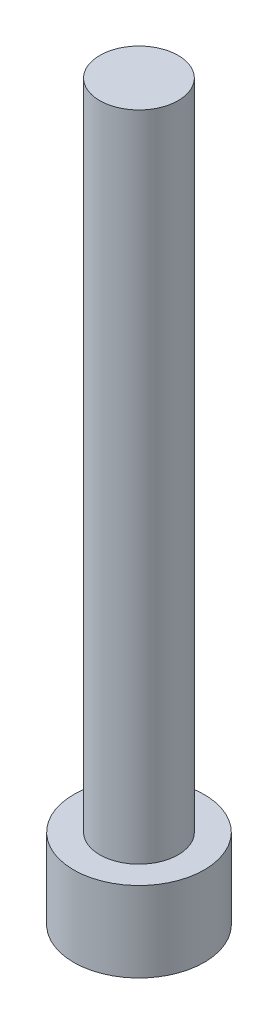
ISO-10303-21;
HEADER;
FILE_DESCRIPTION(('STEP AP214'),'2;1');
FILE_NAME('part.step','',(''),(''),'','','');
FILE_SCHEMA(('AUTOMOTIVE_DESIGN { 1 0 10303 214 1 1 1 1 }'));
ENDSEC;
DATA;
#1=APPLICATION_CONTEXT('core data for automotive mechanical design processes');
#2=APPLICATION_PROTOCOL_DEFINITION('international standard','automotive_design',2000,#1);
#3=PRODUCT_CONTEXT('',#1,'mechanical');
#4=PRODUCT('Part','Part','',(#3));
#5=PRODUCT_RELATED_PRODUCT_CATEGORY('part','',(#4));
#6=PRODUCT_DEFINITION_FORMATION('','',#4);
#7=PRODUCT_DEFINITION_CONTEXT('part definition',#1,'design');
#8=PRODUCT_DEFINITION('design','',#6,#7);
#9=PRODUCT_DEFINITION_SHAPE('','',#8);
#10=(LENGTH_UNIT() NAMED_UNIT(*) SI_UNIT(.MILLI.,.METRE.));
#11=(NAMED_UNIT(*) PLANE_ANGLE_UNIT() SI_UNIT($,.RADIAN.));
#12=(NAMED_UNIT(*) SI_UNIT($,.STERADIAN.) SOLID_ANGLE_UNIT());
#13=UNCERTAINTY_MEASURE_WITH_UNIT(LENGTH_MEASURE(1.E-05),#10,'distance_accuracy_value','');
#14=(GEOMETRIC_REPRESENTATION_CONTEXT(3) GLOBAL_UNCERTAINTY_ASSIGNED_CONTEXT((#13)) GLOBAL_UNIT_ASSIGNED_CONTEXT((#10,
#11,#12)) REPRESENTATION_CONTEXT('',''));
#15=CARTESIAN_POINT('',(0.,0.,0.));
#16=DIRECTION('',(0.,0.,1.));
#17=DIRECTION('',(1.,0.,0.));
#18=AXIS2_PLACEMENT_3D('',#15,#16,#17);
#19=CARTESIAN_POINT('',(0.,3.5052,0.));
#20=DIRECTION('',(0.,1.,0.));
#21=DIRECTION('',(0.,0.,1.));
#22=AXIS2_PLACEMENT_3D('',#19,#20,#21);
#23=PLANE('',#22);
#24=CARTESIAN_POINT('',(0.,3.5052,0.));
#25=DIRECTION('',(0.,1.,0.));
#26=DIRECTION('',(0.,0.,1.));
#27=AXIS2_PLACEMENT_3D('',#24,#25,#26);
#28=CIRCLE('',#27,2.8575);
#29=CARTESIAN_POINT('',(0.,3.5052,2.8575));
#30=VERTEX_POINT('',#29);
#31=EDGE_CURVE('E11',#30,#30,#28,.T.);
#32=ORIENTED_EDGE('',*,*,#31,.T.);
#33=EDGE_LOOP('',(#32));
#34=FACE_BOUND('',#33,.T.);
#35=CARTESIAN_POINT('',(0.,3.5052,0.));
#36=DIRECTION('',(0.,1.,0.));
#37=DIRECTION('',(0.,0.,1.));
#38=AXIS2_PLACEMENT_3D('',#35,#36,#37);
#39=CIRCLE('',#38,1.7145);
#40=CARTESIAN_POINT('',(0.,3.5052,1.7145));
#41=VERTEX_POINT('',#40);
#42=EDGE_CURVE('E152',#41,#41,#39,.T.);
#43=ORIENTED_EDGE('',*,*,#42,.F.);
#44=EDGE_LOOP('',(#43));
#45=FACE_BOUND('',#44,.T.);
#46=ADVANCED_FACE('F33',(#34,#45),#23,.T.);
#47=CARTESIAN_POINT('',(0.,3.5052,0.));
#48=DIRECTION('',(0.,-1.,0.));
#49=DIRECTION('',(0.,0.,-1.));
#50=AXIS2_PLACEMENT_3D('',#47,#48,#49);
#51=CYLINDRICAL_SURFACE('',#50,2.8575);
#52=ORIENTED_EDGE('',*,*,#31,.F.);
#53=EDGE_LOOP('',(#52));
#54=FACE_BOUND('',#53,.T.);
#55=CARTESIAN_POINT('',(0.,0.,0.));
#56=DIRECTION('',(0.,1.,0.));
#57=DIRECTION('',(0.,0.,1.));
#58=AXIS2_PLACEMENT_3D('',#55,#56,#57);
#59=CIRCLE('',#58,2.8575);
#60=CARTESIAN_POINT('',(0.,0.,2.8575));
#61=VERTEX_POINT('',#60);
#62=EDGE_CURVE('E37',#61,#61,#59,.T.);
#63=ORIENTED_EDGE('',*,*,#62,.T.);
#64=EDGE_LOOP('',(#63));
#65=FACE_BOUND('',#64,.T.);
#66=ADVANCED_FACE('F35',(#54,#65),#51,.T.);
#67=CARTESIAN_POINT('',(0.,0.,0.));
#68=DIRECTION('',(0.,1.,0.));
#69=DIRECTION('',(0.,0.,1.));
#70=AXIS2_PLACEMENT_3D('',#67,#68,#69);
#71=PLANE('',#70);
#72=DIRECTION('',(-0.500000000000001,0.,0.866025403784438));
#73=VECTOR('',#72,1.);
#74=CARTESIAN_POINT('',(1.60395121659243,0.,0.));
#75=LINE('',#74,#73);
#76=CARTESIAN_POINT('',(1.60395121659243,0.,0.));
#77=VERTEX_POINT('',#76);
#78=CARTESIAN_POINT('',(0.801975608296214,0.,1.3890625));
#79=VERTEX_POINT('',#78);
#80=EDGE_CURVE('E122',#77,#79,#75,.T.);
#81=ORIENTED_EDGE('',*,*,#80,.F.);
#82=DIRECTION('',(0.5,0.,0.866025403784439));
#83=VECTOR('',#82,1.);
#84=CARTESIAN_POINT('',(0.801975608296215,0.,-1.3890625));
#85=LINE('',#84,#83);
#86=CARTESIAN_POINT('',(0.801975608296215,0.,-1.3890625));
#87=VERTEX_POINT('',#86);
#88=EDGE_CURVE('E48',#87,#77,#85,.T.);
#89=ORIENTED_EDGE('',*,*,#88,.F.);
#90=DIRECTION('',(1.,0.,0.));
#91=VECTOR('',#90,1.);
#92=CARTESIAN_POINT('',(-0.801975608296214,0.,-1.3890625));
#93=LINE('',#92,#91);
#94=CARTESIAN_POINT('',(-0.801975608296214,0.,-1.3890625));
#95=VERTEX_POINT('',#94);
#96=EDGE_CURVE('E132',#95,#87,#93,.T.);
#97=ORIENTED_EDGE('',*,*,#96,.F.);
#98=DIRECTION('',(0.5,0.,-0.866025403784438));
#99=VECTOR('',#98,1.);
#100=CARTESIAN_POINT('',(-1.60395121659243,0.,0.));
#101=LINE('',#100,#99);
#102=CARTESIAN_POINT('',(-1.60395121659243,0.,0.));
#103=VERTEX_POINT('',#102);
#104=EDGE_CURVE('E130',#103,#95,#101,.T.);
#105=ORIENTED_EDGE('',*,*,#104,.F.);
#106=DIRECTION('',(-0.5,0.,-0.866025403784439));
#107=VECTOR('',#106,1.);
#108=CARTESIAN_POINT('',(-0.801975608296214,0.,1.3890625));
#109=LINE('',#108,#107);
#110=CARTESIAN_POINT('',(-0.801975608296214,0.,1.3890625));
#111=VERTEX_POINT('',#110);
#112=EDGE_CURVE('E96',#111,#103,#109,.T.);
#113=ORIENTED_EDGE('',*,*,#112,.F.);
#114=DIRECTION('',(-1.,0.,0.));
#115=VECTOR('',#114,1.);
#116=CARTESIAN_POINT('',(0.801975608296214,0.,1.3890625));
#117=LINE('',#116,#115);
#118=EDGE_CURVE('E126',#79,#111,#117,.T.);
#119=ORIENTED_EDGE('',*,*,#118,.F.);
#120=EDGE_LOOP('',(#81,#89,#97,#105,#113,#119));
#121=FACE_BOUND('',#120,.T.);
#122=ORIENTED_EDGE('',*,*,#62,.F.);
#123=EDGE_LOOP('',(#122));
#124=FACE_BOUND('',#123,.T.);
#125=ADVANCED_FACE('F145',(#121,#124),#71,.F.);
#126=CARTESIAN_POINT('',(0.801975608296215,1.9558,-1.3890625));
#127=DIRECTION('',(0.866025403784438,0.,-0.5));
#128=DIRECTION('',(-0.5,0.,-0.866025403784439));
#129=AXIS2_PLACEMENT_3D('',#126,#127,#128);
#130=PLANE('',#129);
#131=ORIENTED_EDGE('',*,*,#88,.T.);
#132=DIRECTION('',(0.,-1.,0.));
#133=VECTOR('',#132,1.);
#134=CARTESIAN_POINT('',(1.60395121659243,1.9558,0.));
#135=LINE('',#134,#133);
#136=CARTESIAN_POINT('',(1.60395121659243,1.9558,0.));
#137=VERTEX_POINT('',#136);
#138=EDGE_CURVE('E78',#137,#77,#135,.T.);
#139=ORIENTED_EDGE('',*,*,#138,.F.);
#140=DIRECTION('',(0.5,0.,0.866025403784439));
#141=VECTOR('',#140,1.);
#142=CARTESIAN_POINT('',(0.801975608296215,1.9558,-1.3890625));
#143=LINE('',#142,#141);
#144=CARTESIAN_POINT('',(0.801975608296215,1.9558,-1.3890625));
#145=VERTEX_POINT('',#144);
#146=EDGE_CURVE('E134',#145,#137,#143,.T.);
#147=ORIENTED_EDGE('',*,*,#146,.F.);
#148=DIRECTION('',(0.,-1.,0.));
#149=VECTOR('',#148,1.);
#150=CARTESIAN_POINT('',(0.801975608296215,1.9558,-1.3890625));
#151=LINE('',#150,#149);
#152=EDGE_CURVE('E56',#145,#87,#151,.T.);
#153=ORIENTED_EDGE('',*,*,#152,.T.);
#154=EDGE_LOOP('',(#131,#139,#147,#153));
#155=FACE_BOUND('',#154,.T.);
#156=ADVANCED_FACE('F174',(#155),#130,.F.);
#157=CARTESIAN_POINT('',(-0.801975608296214,1.9558,-1.3890625));
#158=DIRECTION('',(0.,0.,-1.));
#159=DIRECTION('',(-1.,0.,0.));
#160=AXIS2_PLACEMENT_3D('',#157,#158,#159);
#161=PLANE('',#160);
#162=ORIENTED_EDGE('',*,*,#96,.T.);
#163=ORIENTED_EDGE('',*,*,#152,.F.);
#164=DIRECTION('',(1.,0.,0.));
#165=VECTOR('',#164,1.);
#166=CARTESIAN_POINT('',(-0.801975608296214,1.9558,-1.3890625));
#167=LINE('',#166,#165);
#168=CARTESIAN_POINT('',(-0.801975608296214,1.9558,-1.3890625));
#169=VERTEX_POINT('',#168);
#170=EDGE_CURVE('E108',#169,#145,#167,.T.);
#171=ORIENTED_EDGE('',*,*,#170,.F.);
#172=DIRECTION('',(0.,-1.,0.));
#173=VECTOR('',#172,1.);
#174=CARTESIAN_POINT('',(-0.801975608296214,1.9558,-1.3890625));
#175=LINE('',#174,#173);
#176=EDGE_CURVE('E100',#169,#95,#175,.T.);
#177=ORIENTED_EDGE('',*,*,#176,.T.);
#178=EDGE_LOOP('',(#162,#163,#171,#177));
#179=FACE_BOUND('',#178,.T.);
#180=ADVANCED_FACE('F180',(#179),#161,.F.);
#181=CARTESIAN_POINT('',(-1.60395121659243,1.9558,0.));
#182=DIRECTION('',(-0.866025403784438,0.,-0.5));
#183=DIRECTION('',(-0.5,0.,0.866025403784439));
#184=AXIS2_PLACEMENT_3D('',#181,#182,#183);
#185=PLANE('',#184);
#186=ORIENTED_EDGE('',*,*,#104,.T.);
#187=ORIENTED_EDGE('',*,*,#176,.F.);
#188=DIRECTION('',(0.5,0.,-0.866025403784438));
#189=VECTOR('',#188,1.);
#190=CARTESIAN_POINT('',(-1.60395121659243,1.9558,0.));
#191=LINE('',#190,#189);
#192=CARTESIAN_POINT('',(-1.60395121659243,1.9558,0.));
#193=VERTEX_POINT('',#192);
#194=EDGE_CURVE('E104',#193,#169,#191,.T.);
#195=ORIENTED_EDGE('',*,*,#194,.F.);
#196=DIRECTION('',(0.,-1.,0.));
#197=VECTOR('',#196,1.);
#198=CARTESIAN_POINT('',(-1.60395121659243,1.9558,0.));
#199=LINE('',#198,#197);
#200=EDGE_CURVE('E89',#193,#103,#199,.T.);
#201=ORIENTED_EDGE('',*,*,#200,.T.);
#202=EDGE_LOOP('',(#186,#187,#195,#201));
#203=FACE_BOUND('',#202,.T.);
#204=ADVANCED_FACE('F105',(#203),#185,.F.);
#205=CARTESIAN_POINT('',(-0.801975608296214,1.9558,1.3890625));
#206=DIRECTION('',(-0.866025403784439,0.,0.5));
#207=DIRECTION('',(0.5,0.,0.866025403784439));
#208=AXIS2_PLACEMENT_3D('',#205,#206,#207);
#209=PLANE('',#208);
#210=ORIENTED_EDGE('',*,*,#112,.T.);
#211=ORIENTED_EDGE('',*,*,#200,.F.);
#212=DIRECTION('',(-0.5,0.,-0.866025403784439));
#213=VECTOR('',#212,1.);
#214=CARTESIAN_POINT('',(-0.801975608296214,1.9558,1.3890625));
#215=LINE('',#214,#213);
#216=CARTESIAN_POINT('',(-0.801975608296214,1.9558,1.3890625));
#217=VERTEX_POINT('',#216);
#218=EDGE_CURVE('E93',#217,#193,#215,.T.);
#219=ORIENTED_EDGE('',*,*,#218,.F.);
#220=DIRECTION('',(0.,-1.,0.));
#221=VECTOR('',#220,1.);
#222=CARTESIAN_POINT('',(-0.801975608296214,1.9558,1.3890625));
#223=LINE('',#222,#221);
#224=EDGE_CURVE('E101',#217,#111,#223,.T.);
#225=ORIENTED_EDGE('',*,*,#224,.T.);
#226=EDGE_LOOP('',(#210,#211,#219,#225));
#227=FACE_BOUND('',#226,.T.);
#228=ADVANCED_FACE('F91',(#227),#209,.F.);
#229=CARTESIAN_POINT('',(0.801975608296214,1.9558,1.3890625));
#230=DIRECTION('',(0.,0.,1.));
#231=DIRECTION('',(1.,0.,0.));
#232=AXIS2_PLACEMENT_3D('',#229,#230,#231);
#233=PLANE('',#232);
#234=ORIENTED_EDGE('',*,*,#118,.T.);
#235=ORIENTED_EDGE('',*,*,#224,.F.);
#236=DIRECTION('',(-1.,0.,0.));
#237=VECTOR('',#236,1.);
#238=CARTESIAN_POINT('',(0.801975608296214,1.9558,1.3890625));
#239=LINE('',#238,#237);
#240=CARTESIAN_POINT('',(0.801975608296214,1.9558,1.3890625));
#241=VERTEX_POINT('',#240);
#242=EDGE_CURVE('E114',#241,#217,#239,.T.);
#243=ORIENTED_EDGE('',*,*,#242,.F.);
#244=DIRECTION('',(0.,-1.,0.));
#245=VECTOR('',#244,1.);
#246=CARTESIAN_POINT('',(0.801975608296214,1.9558,1.3890625));
#247=LINE('',#246,#245);
#248=EDGE_CURVE('E138',#241,#79,#247,.T.);
#249=ORIENTED_EDGE('',*,*,#248,.T.);
#250=EDGE_LOOP('',(#234,#235,#243,#249));
#251=FACE_BOUND('',#250,.T.);
#252=ADVANCED_FACE('F149',(#251),#233,.F.);
#253=CARTESIAN_POINT('',(1.60395121659243,1.9558,0.));
#254=DIRECTION('',(0.866025403784438,0.,0.500000000000001));
#255=DIRECTION('',(0.500000000000001,0.,-0.866025403784438));
#256=AXIS2_PLACEMENT_3D('',#253,#254,#255);
#257=PLANE('',#256);
#258=ORIENTED_EDGE('',*,*,#80,.T.);
#259=ORIENTED_EDGE('',*,*,#248,.F.);
#260=DIRECTION('',(-0.500000000000001,0.,0.866025403784438));
#261=VECTOR('',#260,1.);
#262=CARTESIAN_POINT('',(1.60395121659243,1.9558,0.));
#263=LINE('',#262,#261);
#264=EDGE_CURVE('E116',#137,#241,#263,.T.);
#265=ORIENTED_EDGE('',*,*,#264,.F.);
#266=ORIENTED_EDGE('',*,*,#138,.T.);
#267=EDGE_LOOP('',(#258,#259,#265,#266));
#268=FACE_BOUND('',#267,.T.);
#269=ADVANCED_FACE('F142',(#268),#257,.F.);
#270=CARTESIAN_POINT('',(0.,1.9558,0.));
#271=DIRECTION('',(0.,-1.,0.));
#272=DIRECTION('',(0.,0.,-1.));
#273=AXIS2_PLACEMENT_3D('',#270,#271,#272);
#274=PLANE('',#273);
#275=ORIENTED_EDGE('',*,*,#146,.T.);
#276=ORIENTED_EDGE('',*,*,#264,.T.);
#277=ORIENTED_EDGE('',*,*,#242,.T.);
#278=ORIENTED_EDGE('',*,*,#218,.T.);
#279=ORIENTED_EDGE('',*,*,#194,.T.);
#280=ORIENTED_EDGE('',*,*,#170,.T.);
#281=EDGE_LOOP('',(#275,#276,#277,#278,#279,#280));
#282=FACE_BOUND('',#281,.T.);
#283=ADVANCED_FACE('F111',(#282),#274,.T.);
#284=CARTESIAN_POINT('',(0.,32.0802,0.));
#285=DIRECTION('',(0.,-1.,0.));
#286=DIRECTION('',(0.,0.,-1.));
#287=AXIS2_PLACEMENT_3D('',#284,#285,#286);
#288=CYLINDRICAL_SURFACE('',#287,1.7145);
#289=CARTESIAN_POINT('',(0.,32.0802,0.));
#290=DIRECTION('',(0.,1.,0.));
#291=DIRECTION('',(0.,0.,1.));
#292=AXIS2_PLACEMENT_3D('',#289,#290,#291);
#293=CIRCLE('',#292,1.7145);
#294=CARTESIAN_POINT('',(0.,32.0802,1.7145));
#295=VERTEX_POINT('',#294);
#296=EDGE_CURVE('E123',#295,#295,#293,.T.);
#297=ORIENTED_EDGE('',*,*,#296,.F.);
#298=EDGE_LOOP('',(#297));
#299=FACE_BOUND('',#298,.T.);
#300=ORIENTED_EDGE('',*,*,#42,.T.);
#301=EDGE_LOOP('',(#300));
#302=FACE_BOUND('',#301,.T.);
#303=ADVANCED_FACE('F160',(#299,#302),#288,.T.);
#304=CARTESIAN_POINT('',(0.,32.0802,0.));
#305=DIRECTION('',(0.,1.,0.));
#306=DIRECTION('',(0.,0.,1.));
#307=AXIS2_PLACEMENT_3D('',#304,#305,#306);
#308=PLANE('',#307);
#309=ORIENTED_EDGE('',*,*,#296,.T.);
#310=EDGE_LOOP('',(#309));
#311=FACE_BOUND('',#310,.T.);
#312=ADVANCED_FACE('F158',(#311),#308,.T.);
#313=CLOSED_SHELL('',(#46,#66,#125,#156,#180,#204,#228,#252,#269,#283,#303,#312));
#314=MANIFOLD_SOLID_BREP('B2',#313);
#315=ADVANCED_BREP_SHAPE_REPRESENTATION('',(#18,#314),#14);
#316=SHAPE_DEFINITION_REPRESENTATION(#9,#315);
ENDSEC;
END-ISO-10303-21;
